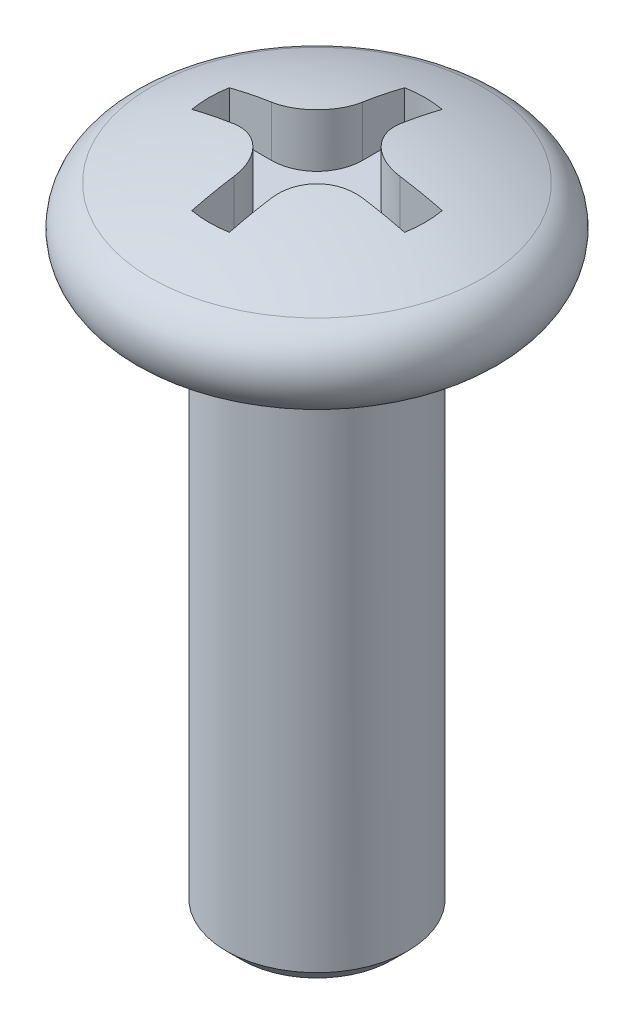
ISO-10303-21;
HEADER;
FILE_DESCRIPTION(('STEP AP214'),'2;1');
FILE_NAME('part.step','',(''),(''),'','','');
FILE_SCHEMA(('AUTOMOTIVE_DESIGN { 1 0 10303 214 1 1 1 1 }'));
ENDSEC;
DATA;
#1=APPLICATION_CONTEXT('core data for automotive mechanical design processes');
#2=APPLICATION_PROTOCOL_DEFINITION('international standard','automotive_design',2000,#1);
#3=PRODUCT_CONTEXT('',#1,'mechanical');
#4=PRODUCT('Part','Part','',(#3));
#5=PRODUCT_RELATED_PRODUCT_CATEGORY('part','',(#4));
#6=PRODUCT_DEFINITION_FORMATION('','',#4);
#7=PRODUCT_DEFINITION_CONTEXT('part definition',#1,'design');
#8=PRODUCT_DEFINITION('design','',#6,#7);
#9=PRODUCT_DEFINITION_SHAPE('','',#8);
#10=(LENGTH_UNIT() NAMED_UNIT(*) SI_UNIT(.MILLI.,.METRE.));
#11=(NAMED_UNIT(*) PLANE_ANGLE_UNIT() SI_UNIT($,.RADIAN.));
#12=(NAMED_UNIT(*) SI_UNIT($,.STERADIAN.) SOLID_ANGLE_UNIT());
#13=UNCERTAINTY_MEASURE_WITH_UNIT(LENGTH_MEASURE(1.E-05),#10,'distance_accuracy_value','');
#14=(GEOMETRIC_REPRESENTATION_CONTEXT(3) GLOBAL_UNCERTAINTY_ASSIGNED_CONTEXT((#13)) GLOBAL_UNIT_ASSIGNED_CONTEXT((#10,
#11,#12)) REPRESENTATION_CONTEXT('',''));
#15=CARTESIAN_POINT('',(0.,0.,0.));
#16=DIRECTION('',(0.,0.,1.));
#17=DIRECTION('',(1.,0.,0.));
#18=AXIS2_PLACEMENT_3D('',#15,#16,#17);
#19=CARTESIAN_POINT('',(0.,0.8,0.));
#20=DIRECTION('',(0.,-1.,0.));
#21=DIRECTION('',(0.,0.,-1.));
#22=AXIS2_PLACEMENT_3D('',#19,#20,#21);
#23=PLANE('',#22);
#24=DIRECTION('',(0.,0.,1.));
#25=VECTOR('',#24,1.);
#26=CARTESIAN_POINT('',(-0.2692388155425,0.8,1.526437178598));
#27=LINE('',#26,#25);
#28=CARTESIAN_POINT('',(-0.2692388155425,0.8,0.9192388155425));
#29=VERTEX_POINT('',#28);
#30=CARTESIAN_POINT('',(-0.2692388155425,0.8,1.52643717859784));
#31=VERTEX_POINT('',#30);
#32=EDGE_CURVE('P0_E159',#29,#31,#27,.T.);
#33=ORIENTED_EDGE('',*,*,#32,.T.);
#34=CARTESIAN_POINT('',(0.,0.8,0.));
#35=DIRECTION('',(0.,-1.,0.));
#36=DIRECTION('',(0.,0.,-1.));
#37=AXIS2_PLACEMENT_3D('',#34,#35,#36);
#38=CIRCLE('',#37,1.55);
#39=CARTESIAN_POINT('',(0.269238815542473,0.8,1.52643717859769));
#40=VERTEX_POINT('',#39);
#41=EDGE_CURVE('P0_E233',#31,#40,#38,.F.);
#42=ORIENTED_EDGE('',*,*,#41,.T.);
#43=DIRECTION('',(0.,0.,-1.));
#44=VECTOR('',#43,1.);
#45=CARTESIAN_POINT('',(0.2692388155425,0.8,0.9192388155425));
#46=LINE('',#45,#44);
#47=CARTESIAN_POINT('',(0.2692388155425,0.8,0.9192388155425));
#48=VERTEX_POINT('',#47);
#49=EDGE_CURVE('P0_E163',#40,#48,#46,.T.);
#50=ORIENTED_EDGE('',*,*,#49,.T.);
#51=CARTESIAN_POINT('',(0.9192388155425,0.8,0.9192388155425));
#52=DIRECTION('',(0.,-1.,0.));
#53=DIRECTION('',(0.,0.,-1.));
#54=AXIS2_PLACEMENT_3D('',#51,#52,#53);
#55=CIRCLE('',#54,0.65);
#56=CARTESIAN_POINT('',(0.9192388155425,0.8,0.2692388155425));
#57=VERTEX_POINT('',#56);
#58=EDGE_CURVE('P0_E166',#57,#48,#55,.F.);
#59=ORIENTED_EDGE('',*,*,#58,.F.);
#60=DIRECTION('',(1.,0.,0.));
#61=VECTOR('',#60,1.);
#62=CARTESIAN_POINT('',(1.526437178598,0.8,0.2692388155425));
#63=LINE('',#62,#61);
#64=CARTESIAN_POINT('',(1.52643717859784,0.8,0.2692388155425));
#65=VERTEX_POINT('',#64);
#66=EDGE_CURVE('P0_E167',#57,#65,#63,.T.);
#67=ORIENTED_EDGE('',*,*,#66,.T.);
#68=CARTESIAN_POINT('',(0.,0.8,0.));
#69=DIRECTION('',(0.,-1.,0.));
#70=DIRECTION('',(0.,0.,-1.));
#71=AXIS2_PLACEMENT_3D('',#68,#69,#70);
#72=CIRCLE('',#71,1.55);
#73=CARTESIAN_POINT('',(1.52643717859769,0.8,-0.269238815542473));
#74=VERTEX_POINT('',#73);
#75=EDGE_CURVE('P0_E244',#65,#74,#72,.F.);
#76=ORIENTED_EDGE('',*,*,#75,.T.);
#77=DIRECTION('',(-1.,0.,0.));
#78=VECTOR('',#77,1.);
#79=CARTESIAN_POINT('',(0.9192388155425,0.8,-0.2692388155425));
#80=LINE('',#79,#78);
#81=CARTESIAN_POINT('',(0.9192388155425,0.8,-0.2692388155425));
#82=VERTEX_POINT('',#81);
#83=EDGE_CURVE('P0_E171',#74,#82,#80,.T.);
#84=ORIENTED_EDGE('',*,*,#83,.T.);
#85=CARTESIAN_POINT('',(0.9192388155425,0.8,-0.9192388155425));
#86=DIRECTION('',(0.,-1.,0.));
#87=DIRECTION('',(0.,0.,-1.));
#88=AXIS2_PLACEMENT_3D('',#85,#86,#87);
#89=CIRCLE('',#88,0.65);
#90=CARTESIAN_POINT('',(0.2692388155425,0.8,-0.9192388155425));
#91=VERTEX_POINT('',#90);
#92=EDGE_CURVE('P0_E174',#91,#82,#89,.F.);
#93=ORIENTED_EDGE('',*,*,#92,.F.);
#94=DIRECTION('',(0.,0.,-1.));
#95=VECTOR('',#94,1.);
#96=CARTESIAN_POINT('',(0.2692388155425,0.8,-1.526437178598));
#97=LINE('',#96,#95);
#98=CARTESIAN_POINT('',(0.2692388155425,0.8,-1.52643717859784));
#99=VERTEX_POINT('',#98);
#100=EDGE_CURVE('P0_E176',#91,#99,#97,.T.);
#101=ORIENTED_EDGE('',*,*,#100,.T.);
#102=CARTESIAN_POINT('',(0.,0.8,0.));
#103=DIRECTION('',(0.,-1.,0.));
#104=DIRECTION('',(0.,0.,-1.));
#105=AXIS2_PLACEMENT_3D('',#102,#103,#104);
#106=CIRCLE('',#105,1.55);
#107=CARTESIAN_POINT('',(-0.269238815542474,0.8,-1.52643717859769));
#108=VERTEX_POINT('',#107);
#109=EDGE_CURVE('P0_E135',#99,#108,#106,.F.);
#110=ORIENTED_EDGE('',*,*,#109,.T.);
#111=DIRECTION('',(0.,0.,1.));
#112=VECTOR('',#111,1.);
#113=CARTESIAN_POINT('',(-0.2692388155425,0.8,-0.9192388155425));
#114=LINE('',#113,#112);
#115=CARTESIAN_POINT('',(-0.2692388155425,0.8,-0.9192388155425));
#116=VERTEX_POINT('',#115);
#117=EDGE_CURVE('P0_E131',#108,#116,#114,.T.);
#118=ORIENTED_EDGE('',*,*,#117,.T.);
#119=CARTESIAN_POINT('',(-0.9192388155425,0.8,-0.9192388155425));
#120=DIRECTION('',(0.,-1.,0.));
#121=DIRECTION('',(0.,0.,-1.));
#122=AXIS2_PLACEMENT_3D('',#119,#120,#121);
#123=CIRCLE('',#122,0.65);
#124=CARTESIAN_POINT('',(-0.9192388155425,0.8,-0.2692388155425));
#125=VERTEX_POINT('',#124);
#126=EDGE_CURVE('P0_E19',#125,#116,#123,.F.);
#127=ORIENTED_EDGE('',*,*,#126,.F.);
#128=DIRECTION('',(-1.,0.,0.));
#129=VECTOR('',#128,1.);
#130=CARTESIAN_POINT('',(-1.526437178598,0.8,-0.2692388155425));
#131=LINE('',#130,#129);
#132=CARTESIAN_POINT('',(-1.52643717859769,0.8,-0.269238815542473));
#133=VERTEX_POINT('',#132);
#134=EDGE_CURVE('P0_E126',#125,#133,#131,.T.);
#135=ORIENTED_EDGE('',*,*,#134,.T.);
#136=CARTESIAN_POINT('',(0.,0.8,0.));
#137=DIRECTION('',(0.,-1.,0.));
#138=DIRECTION('',(0.,0.,-1.));
#139=AXIS2_PLACEMENT_3D('',#136,#137,#138);
#140=CIRCLE('',#139,1.55);
#141=CARTESIAN_POINT('',(-1.52643717859784,0.8,0.2692388155425));
#142=VERTEX_POINT('',#141);
#143=EDGE_CURVE('P0_E241',#133,#142,#140,.F.);
#144=ORIENTED_EDGE('',*,*,#143,.T.);
#145=DIRECTION('',(1.,0.,0.));
#146=VECTOR('',#145,1.);
#147=CARTESIAN_POINT('',(-0.9192388155425,0.8,0.2692388155425));
#148=LINE('',#147,#146);
#149=CARTESIAN_POINT('',(-0.9192388155425,0.8,0.2692388155425));
#150=VERTEX_POINT('',#149);
#151=EDGE_CURVE('P0_E156',#142,#150,#148,.T.);
#152=ORIENTED_EDGE('',*,*,#151,.T.);
#153=CARTESIAN_POINT('',(-0.9192388155425,0.8,0.9192388155425));
#154=DIRECTION('',(0.,-1.,0.));
#155=DIRECTION('',(0.,0.,-1.));
#156=AXIS2_PLACEMENT_3D('',#153,#154,#155);
#157=CIRCLE('',#156,0.65);
#158=EDGE_CURVE('P0_E227',#29,#150,#157,.F.);
#159=ORIENTED_EDGE('',*,*,#158,.F.);
#160=EDGE_LOOP('',(#33,#42,#50,#59,#67,#76,#84,#93,#101,#110,#118,#127,#135,#144,#152,#159));
#161=FACE_BOUND('',#160,.T.);
#162=ADVANCED_FACE('P0_F16',(#161),#23,.F.);
#163=CARTESIAN_POINT('',(-1.526437178598,0.8,-0.2692388155425));
#164=DIRECTION('',(0.,0.,-1.));
#165=DIRECTION('',(-1.,0.,0.));
#166=AXIS2_PLACEMENT_3D('',#163,#164,#165);
#167=PLANE('',#166);
#168=ORIENTED_EDGE('',*,*,#134,.F.);
#169=DIRECTION('',(0.,-1.,0.));
#170=VECTOR('',#169,1.);
#171=CARTESIAN_POINT('',(-0.9192388155425,0.8,-0.2692388155425));
#172=LINE('',#171,#170);
#173=CARTESIAN_POINT('',(-0.919238815542486,1.52471377217491,-0.269238815542499));
#174=VERTEX_POINT('',#173);
#175=EDGE_CURVE('P0_E145',#174,#125,#172,.T.);
#176=ORIENTED_EDGE('',*,*,#175,.F.);
#177=CARTESIAN_POINT('',(-1.52643717859785,1.4008340553469,-0.269238815542501));
#178=CARTESIAN_POINT('',(-1.42628258533272,1.42660341497327,-0.269238815542501));
#179=CARTESIAN_POINT('',(-1.32560542511221,1.44981140452212,-0.269238815542501));
#180=CARTESIAN_POINT('',(-1.12320597076042,1.49110464346476,-0.269238815542499));
#181=CARTESIAN_POINT('',(-1.02148367662914,1.50918989285855,-0.269238815542499));
#182=CARTESIAN_POINT('',(-0.919238815542473,1.52471377217482,-0.269238815542498));
#183=B_SPLINE_CURVE_WITH_KNOTS('',3,(#177,#178,#179,#180,#181,#182),.UNSPECIFIED.,.F.,.F.,(4,2,
4),(0.,0.30995243557794,0.61990487115588),.UNSPECIFIED.);
#184=CARTESIAN_POINT('',(-1.52643717859777,1.40083405534695,-0.269238815542474));
#185=VERTEX_POINT('',#184);
#186=EDGE_CURVE('P0_E224',#185,#174,#183,.T.);
#187=ORIENTED_EDGE('',*,*,#186,.F.);
#188=DIRECTION('',(0.,-1.,0.));
#189=VECTOR('',#188,1.);
#190=CARTESIAN_POINT('',(-1.5264371785977,0.8,-0.269238815542447));
#191=LINE('',#190,#189);
#192=EDGE_CURVE('P0_E239',#185,#133,#191,.T.);
#193=ORIENTED_EDGE('',*,*,#192,.T.);
#194=EDGE_LOOP('',(#168,#176,#187,#193));
#195=FACE_BOUND('',#194,.T.);
#196=ADVANCED_FACE('P0_F284',(#195),#167,.F.);
#197=CARTESIAN_POINT('',(-0.9192388155425,0.8,-0.9192388155425));
#198=DIRECTION('',(0.,-1.,0.));
#199=DIRECTION('',(0.,0.,-1.));
#200=AXIS2_PLACEMENT_3D('',#197,#198,#199);
#201=CYLINDRICAL_SURFACE('',#200,0.65);
#202=DIRECTION('',(0.,1.,0.));
#203=VECTOR('',#202,1.);
#204=CARTESIAN_POINT('',(-0.2692388155425,0.8,-0.9192388155425));
#205=LINE('',#204,#203);
#206=CARTESIAN_POINT('',(-0.2692388155425,1.52471377217491,-0.9192388155425));
#207=VERTEX_POINT('',#206);
#208=EDGE_CURVE('P0_E139',#116,#207,#205,.T.);
#209=ORIENTED_EDGE('',*,*,#208,.T.);
#210=CARTESIAN_POINT('',(-0.919238815542473,1.52471377217482,-0.269238815542498));
#211=CARTESIAN_POINT('',(-0.883271069284549,1.53017838215663,-0.269206596368218));
#212=CARTESIAN_POINT('',(-0.847230957030024,1.53518398680926,-0.272222835690409));
#213=CARTESIAN_POINT('',(-0.776024482266568,1.54415362187527,-0.284194183766014));
#214=CARTESIAN_POINT('',(-0.740857976412674,1.54811782420211,-0.293148311438724));
#215=CARTESIAN_POINT('',(-0.67237147630745,1.5548862554609,-0.31684896030274));
#216=CARTESIAN_POINT('',(-0.639053304502208,1.55768935656104,-0.331601086387426));
#217=CARTESIAN_POINT('',(-0.575297778798747,1.56204492956573,-0.366496760027209));
#218=CARTESIAN_POINT('',(-0.544859240050172,1.56359791783259,-0.386638076978));
#219=CARTESIAN_POINT('',(-0.488097063461272,1.56539571440068,-0.43147904324595));
#220=CARTESIAN_POINT('',(-0.46172860298219,1.56565593228317,-0.456121349806757));
#221=CARTESIAN_POINT('',(-0.413435525795813,1.56490196217993,-0.509414647326527));
#222=CARTESIAN_POINT('',(-0.391510799474459,1.56388780563376,-0.538065539375815));
#223=CARTESIAN_POINT('',(-0.352825154531399,1.56062536432747,-0.598376464130785));
#224=CARTESIAN_POINT('',(-0.336037032537578,1.55838376285364,-0.630019440211366));
#225=CARTESIAN_POINT('',(-0.307904881496571,1.55273696196925,-0.695540633048054));
#226=CARTESIAN_POINT('',(-0.296559537832555,1.54933204387992,-0.729418307797177));
#227=CARTESIAN_POINT('',(-0.281799832125994,1.54249219211063,-0.789390970708279));
#228=CARTESIAN_POINT('',(-0.277087023520738,1.53929822937967,-0.815202930682553));
#229=CARTESIAN_POINT('',(-0.270805742102409,1.53238664939425,-0.867099473917436));
#230=CARTESIAN_POINT('',(-0.269232761212041,1.5286697911244,-0.893183612184108));
#231=CARTESIAN_POINT('',(-0.2692388155425,1.52471377217482,-0.91923881554247));
#232=B_SPLINE_CURVE_WITH_KNOTS('',3,(#210,#211,#212,#213,#214,#215,#216,#217,#218,#219,#220,
#221,#222,#223,#224,#225,#226,#227,#228,#229,#230,#231),.UNSPECIFIED.,.F.,.F.,(4,2,2,2,2,2,2,2,
2,2,4),(0.,0.109017930799935,0.218017853725245,0.327123406477723,0.436183869743588,
0.543941180487169,0.651695832846218,0.758869525629327,0.866017319256549,0.945129051904784,
1.02412711619082),.UNSPECIFIED.);
#233=EDGE_CURVE('P0_E266',#174,#207,#232,.T.);
#234=ORIENTED_EDGE('',*,*,#233,.F.);
#235=ORIENTED_EDGE('',*,*,#175,.T.);
#236=ORIENTED_EDGE('',*,*,#126,.T.);
#237=EDGE_LOOP('',(#209,#234,#235,#236));
#238=FACE_BOUND('',#237,.T.);
#239=ADVANCED_FACE('P0_F142',(#238),#201,.T.);
#240=CARTESIAN_POINT('',(-0.2692388155425,0.8,-0.9192388155425));
#241=DIRECTION('',(-1.,0.,0.));
#242=DIRECTION('',(0.,0.,1.));
#243=AXIS2_PLACEMENT_3D('',#240,#241,#242);
#244=PLANE('',#243);
#245=ORIENTED_EDGE('',*,*,#117,.F.);
#246=DIRECTION('',(0.,-1.,0.));
#247=VECTOR('',#246,1.);
#248=CARTESIAN_POINT('',(-0.269238815542447,0.8,-1.5264371785977));
#249=LINE('',#248,#247);
#250=CARTESIAN_POINT('',(-0.2692388155425,1.40083405534697,-1.52643717859763));
#251=VERTEX_POINT('',#250);
#252=EDGE_CURVE('P0_E151',#108,#251,#249,.F.);
#253=ORIENTED_EDGE('',*,*,#252,.T.);
#254=CARTESIAN_POINT('',(-0.2692388155425,-4.530985590342,0.));
#255=DIRECTION('',(-1.,0.,0.));
#256=DIRECTION('',(0.,0.,1.));
#257=AXIS2_PLACEMENT_3D('',#254,#255,#256);
#258=CIRCLE('',#257,6.12507100115472);
#259=EDGE_CURVE('P0_E148',#207,#251,#258,.T.);
#260=ORIENTED_EDGE('',*,*,#259,.F.);
#261=ORIENTED_EDGE('',*,*,#208,.F.);
#262=EDGE_LOOP('',(#245,#253,#260,#261));
#263=FACE_BOUND('',#262,.T.);
#264=ADVANCED_FACE('P0_F146',(#263),#244,.F.);
#265=CARTESIAN_POINT('',(0.,0.8,0.));
#266=DIRECTION('',(0.,-1.,0.));
#267=DIRECTION('',(0.,0.,-1.));
#268=AXIS2_PLACEMENT_3D('',#265,#266,#267);
#269=CYLINDRICAL_SURFACE('',#268,1.55);
#270=ORIENTED_EDGE('',*,*,#109,.F.);
#271=DIRECTION('',(0.,1.,0.));
#272=VECTOR('',#271,1.);
#273=CARTESIAN_POINT('',(0.2692388155425,0.8,-1.526437178598));
#274=LINE('',#273,#272);
#275=CARTESIAN_POINT('',(0.269238815542501,1.40083405534693,-1.52643717859778));
#276=VERTEX_POINT('',#275);
#277=EDGE_CURVE('P0_E177',#99,#276,#274,.T.);
#278=ORIENTED_EDGE('',*,*,#277,.T.);
#279=CARTESIAN_POINT('',(0.,1.400834055347,0.));
#280=DIRECTION('',(0.,-1.,0.));
#281=DIRECTION('',(0.,0.,-1.));
#282=AXIS2_PLACEMENT_3D('',#279,#280,#281);
#283=CIRCLE('',#282,1.55);
#284=EDGE_CURVE('P0_E254',#251,#276,#283,.T.);
#285=ORIENTED_EDGE('',*,*,#284,.F.);
#286=ORIENTED_EDGE('',*,*,#252,.F.);
#287=EDGE_LOOP('',(#270,#278,#285,#286));
#288=FACE_BOUND('',#287,.T.);
#289=ADVANCED_FACE('P0_F252',(#288),#269,.F.);
#290=CARTESIAN_POINT('',(0.2692388155425,0.8,-1.526437178598));
#291=DIRECTION('',(1.,0.,0.));
#292=DIRECTION('',(0.,0.,-1.));
#293=AXIS2_PLACEMENT_3D('',#290,#291,#292);
#294=PLANE('',#293);
#295=ORIENTED_EDGE('',*,*,#100,.F.);
#296=DIRECTION('',(0.,-1.,0.));
#297=VECTOR('',#296,1.);
#298=CARTESIAN_POINT('',(0.2692388155425,0.8,-0.9192388155425));
#299=LINE('',#298,#297);
#300=CARTESIAN_POINT('',(0.2692388155425,1.52471377217491,-0.9192388155425));
#301=VERTEX_POINT('',#300);
#302=EDGE_CURVE('P0_E246',#301,#91,#299,.T.);
#303=ORIENTED_EDGE('',*,*,#302,.F.);
#304=CARTESIAN_POINT('',(0.269238815542501,-4.530985590342,0.));
#305=DIRECTION('',(-1.,0.,0.));
#306=DIRECTION('',(0.,0.,1.));
#307=AXIS2_PLACEMENT_3D('',#304,#305,#306);
#308=CIRCLE('',#307,6.12507100115472);
#309=EDGE_CURVE('P0_E257',#276,#301,#308,.F.);
#310=ORIENTED_EDGE('',*,*,#309,.F.);
#311=ORIENTED_EDGE('',*,*,#277,.F.);
#312=EDGE_LOOP('',(#295,#303,#310,#311));
#313=FACE_BOUND('',#312,.T.);
#314=ADVANCED_FACE('P0_F258',(#313),#294,.F.);
#315=CARTESIAN_POINT('',(0.9192388155425,0.8,-0.9192388155425));
#316=DIRECTION('',(0.,-1.,0.));
#317=DIRECTION('',(0.,0.,-1.));
#318=AXIS2_PLACEMENT_3D('',#315,#316,#317);
#319=CYLINDRICAL_SURFACE('',#318,0.65);
#320=DIRECTION('',(0.,1.,0.));
#321=VECTOR('',#320,1.);
#322=CARTESIAN_POINT('',(0.9192388155425,0.8,-0.2692388155425));
#323=LINE('',#322,#321);
#324=CARTESIAN_POINT('',(0.919238815542486,1.52471377217491,-0.269238815542499));
#325=VERTEX_POINT('',#324);
#326=EDGE_CURVE('P0_E173',#82,#325,#323,.T.);
#327=ORIENTED_EDGE('',*,*,#326,.T.);
#328=CARTESIAN_POINT('',(0.269238815542501,1.52471377217482,-0.91923881554247));
#329=CARTESIAN_POINT('',(0.269206596368221,1.53017838215663,-0.883271069284547));
#330=CARTESIAN_POINT('',(0.272222835690411,1.53518398680925,-0.847230957030023));
#331=CARTESIAN_POINT('',(0.284194183766012,1.54415362187527,-0.776024482266571));
#332=CARTESIAN_POINT('',(0.293148311438721,1.54811782420211,-0.740857976412679));
#333=CARTESIAN_POINT('',(0.316848960302734,1.5548862554609,-0.672371476307457));
#334=CARTESIAN_POINT('',(0.331601086387421,1.55768935656104,-0.639053304502217));
#335=CARTESIAN_POINT('',(0.366496760027204,1.56204492956573,-0.575297778798759));
#336=CARTESIAN_POINT('',(0.386638076977993,1.56359791783258,-0.544859240050185));
#337=CARTESIAN_POINT('',(0.431479043245941,1.56539571440068,-0.488097063461286));
#338=CARTESIAN_POINT('',(0.456121349806746,1.56565593228317,-0.461728602982201));
#339=CARTESIAN_POINT('',(0.509414647326515,1.56490196217993,-0.413435525795823));
#340=CARTESIAN_POINT('',(0.538065539375803,1.56388780563376,-0.39151079947447));
#341=CARTESIAN_POINT('',(0.598376464130773,1.56062536432747,-0.352825154531409));
#342=CARTESIAN_POINT('',(0.630019440211352,1.55838376285364,-0.336037032537586));
#343=CARTESIAN_POINT('',(0.695540633048038,1.55273696196925,-0.307904881496575));
#344=CARTESIAN_POINT('',(0.729418307797161,1.54933204387992,-0.296559537832558));
#345=CARTESIAN_POINT('',(0.789390970708265,1.54249219211063,-0.281799832125995));
#346=CARTESIAN_POINT('',(0.815202930682542,1.53929822937967,-0.277087023520739));
#347=CARTESIAN_POINT('',(0.867099473917432,1.53238664939425,-0.27080574210241));
#348=CARTESIAN_POINT('',(0.893183612184107,1.5286697911244,-0.269232761212042));
#349=CARTESIAN_POINT('',(0.919238815542472,1.52471377217482,-0.269238815542499));
#350=B_SPLINE_CURVE_WITH_KNOTS('',3,(#328,#329,#330,#331,#332,#333,#334,#335,#336,#337,#338,
#339,#340,#341,#342,#343,#344,#345,#346,#347,#348,#349),.UNSPECIFIED.,.F.,.F.,(4,2,2,2,2,2,2,2,
2,2,4),(0.,0.109017930799931,0.218017853725235,0.327123406477708,0.436183869743569,
0.54394118048715,0.651695832846199,0.758869525629307,0.866017319256528,0.945129051904774,
1.02412711619081),.UNSPECIFIED.);
#351=EDGE_CURVE('P0_E262',#301,#325,#350,.T.);
#352=ORIENTED_EDGE('',*,*,#351,.F.);
#353=ORIENTED_EDGE('',*,*,#302,.T.);
#354=ORIENTED_EDGE('',*,*,#92,.T.);
#355=EDGE_LOOP('',(#327,#352,#353,#354));
#356=FACE_BOUND('',#355,.T.);
#357=ADVANCED_FACE('P0_F403',(#356),#319,.T.);
#358=CARTESIAN_POINT('',(0.9192388155425,0.8,-0.2692388155425));
#359=DIRECTION('',(0.,0.,-1.));
#360=DIRECTION('',(-1.,0.,0.));
#361=AXIS2_PLACEMENT_3D('',#358,#359,#360);
#362=PLANE('',#361);
#363=ORIENTED_EDGE('',*,*,#83,.F.);
#364=DIRECTION('',(0.,-1.,0.));
#365=VECTOR('',#364,1.);
#366=CARTESIAN_POINT('',(1.5264371785977,0.8,-0.269238815542447));
#367=LINE('',#366,#365);
#368=CARTESIAN_POINT('',(1.52643717859769,1.400834055347,-0.269238815542473));
#369=VERTEX_POINT('',#368);
#370=EDGE_CURVE('P0_E170',#74,#369,#367,.F.);
#371=ORIENTED_EDGE('',*,*,#370,.T.);
#372=CARTESIAN_POINT('',(0.919238815542472,1.52471377217482,-0.269238815542498));
#373=CARTESIAN_POINT('',(1.02148367662914,1.50918989285855,-0.269238815542499));
#374=CARTESIAN_POINT('',(1.12320597076042,1.49110464346476,-0.2692388155425));
#375=CARTESIAN_POINT('',(1.32560542511221,1.44981140452212,-0.269238815542501));
#376=CARTESIAN_POINT('',(1.42628258533272,1.42660341497327,-0.269238815542501));
#377=CARTESIAN_POINT('',(1.52643717859785,1.4008340553469,-0.269238815542501));
#378=B_SPLINE_CURVE_WITH_KNOTS('',3,(#372,#373,#374,#375,#376,#377),.UNSPECIFIED.,.F.,.F.,(4,2,
4),(0.,0.30995243557794,0.61990487115588),.UNSPECIFIED.);
#379=EDGE_CURVE('P0_E510',#325,#369,#378,.T.);
#380=ORIENTED_EDGE('',*,*,#379,.F.);
#381=ORIENTED_EDGE('',*,*,#326,.F.);
#382=EDGE_LOOP('',(#363,#371,#380,#381));
#383=FACE_BOUND('',#382,.T.);
#384=ADVANCED_FACE('P0_F395',(#383),#362,.F.);
#385=CARTESIAN_POINT('',(0.,0.8,0.));
#386=DIRECTION('',(0.,-1.,0.));
#387=DIRECTION('',(0.,0.,-1.));
#388=AXIS2_PLACEMENT_3D('',#385,#386,#387);
#389=CYLINDRICAL_SURFACE('',#388,1.55);
#390=ORIENTED_EDGE('',*,*,#143,.F.);
#391=ORIENTED_EDGE('',*,*,#192,.F.);
#392=CARTESIAN_POINT('',(0.,1.400834055347,0.));
#393=DIRECTION('',(0.,-1.,0.));
#394=DIRECTION('',(0.,0.,-1.));
#395=AXIS2_PLACEMENT_3D('',#392,#393,#394);
#396=CIRCLE('',#395,1.55);
#397=CARTESIAN_POINT('',(-1.52643717859784,1.400834055347,0.2692388155425));
#398=VERTEX_POINT('',#397);
#399=EDGE_CURVE('P0_E517',#398,#185,#396,.T.);
#400=ORIENTED_EDGE('',*,*,#399,.F.);
#401=DIRECTION('',(0.,1.,0.));
#402=VECTOR('',#401,1.);
#403=CARTESIAN_POINT('',(-1.526437178598,0.8,0.2692388155425));
#404=LINE('',#403,#402);
#405=EDGE_CURVE('P0_E158',#398,#142,#404,.F.);
#406=ORIENTED_EDGE('',*,*,#405,.T.);
#407=EDGE_LOOP('',(#390,#391,#400,#406));
#408=FACE_BOUND('',#407,.T.);
#409=ADVANCED_FACE('P0_F387',(#408),#389,.F.);
#410=CARTESIAN_POINT('',(0.,0.8,0.));
#411=DIRECTION('',(0.,-1.,0.));
#412=DIRECTION('',(0.,0.,-1.));
#413=AXIS2_PLACEMENT_3D('',#410,#411,#412);
#414=CYLINDRICAL_SURFACE('',#413,1.55);
#415=ORIENTED_EDGE('',*,*,#370,.F.);
#416=ORIENTED_EDGE('',*,*,#75,.F.);
#417=DIRECTION('',(0.,1.,0.));
#418=VECTOR('',#417,1.);
#419=CARTESIAN_POINT('',(1.526437178598,0.8,0.2692388155425));
#420=LINE('',#419,#418);
#421=CARTESIAN_POINT('',(1.52643717859795,1.40083405534694,0.269238815542502));
#422=VERTEX_POINT('',#421);
#423=EDGE_CURVE('P0_E169',#65,#422,#420,.T.);
#424=ORIENTED_EDGE('',*,*,#423,.T.);
#425=CARTESIAN_POINT('',(0.,1.400834055347,0.));
#426=DIRECTION('',(0.,-1.,0.));
#427=DIRECTION('',(0.,0.,-1.));
#428=AXIS2_PLACEMENT_3D('',#425,#426,#427);
#429=CIRCLE('',#428,1.55);
#430=EDGE_CURVE('P0_E519',#369,#422,#429,.T.);
#431=ORIENTED_EDGE('',*,*,#430,.F.);
#432=EDGE_LOOP('',(#415,#416,#424,#431));
#433=FACE_BOUND('',#432,.T.);
#434=ADVANCED_FACE('P0_F379',(#433),#414,.F.);
#435=CARTESIAN_POINT('',(1.526437178598,0.8,0.2692388155425));
#436=DIRECTION('',(0.,0.,1.));
#437=DIRECTION('',(1.,0.,0.));
#438=AXIS2_PLACEMENT_3D('',#435,#436,#437);
#439=PLANE('',#438);
#440=ORIENTED_EDGE('',*,*,#66,.F.);
#441=DIRECTION('',(0.,-1.,0.));
#442=VECTOR('',#441,1.);
#443=CARTESIAN_POINT('',(0.9192388155425,0.8,0.2692388155425));
#444=LINE('',#443,#442);
#445=CARTESIAN_POINT('',(0.919238815542486,1.52471377217491,0.2692388155425));
#446=VERTEX_POINT('',#445);
#447=EDGE_CURVE('P0_E235',#446,#57,#444,.T.);
#448=ORIENTED_EDGE('',*,*,#447,.F.);
#449=CARTESIAN_POINT('',(1.52643717859791,1.40083405534688,0.269238815542503));
#450=CARTESIAN_POINT('',(1.42628258533277,1.42660341497326,0.269238815542501));
#451=CARTESIAN_POINT('',(1.32560542511225,1.44981140452211,0.2692388155425));
#452=CARTESIAN_POINT('',(1.12320597076043,1.49110464346476,0.2692388155425));
#453=CARTESIAN_POINT('',(1.02148367662915,1.50918989285855,0.2692388155425));
#454=CARTESIAN_POINT('',(0.919238815542472,1.52471377217482,0.269238815542501));
#455=B_SPLINE_CURVE_WITH_KNOTS('',3,(#449,#450,#451,#452,#453,#454),.UNSPECIFIED.,.F.,.F.,(4,2,
4),(0.,0.30995243557797,0.619904871155939),.UNSPECIFIED.);
#456=EDGE_CURVE('P0_E521',#422,#446,#455,.T.);
#457=ORIENTED_EDGE('',*,*,#456,.F.);
#458=ORIENTED_EDGE('',*,*,#423,.F.);
#459=EDGE_LOOP('',(#440,#448,#457,#458));
#460=FACE_BOUND('',#459,.T.);
#461=ADVANCED_FACE('P0_F371',(#460),#439,.F.);
#462=CARTESIAN_POINT('',(0.9192388155425,0.8,0.9192388155425));
#463=DIRECTION('',(0.,-1.,0.));
#464=DIRECTION('',(0.,0.,-1.));
#465=AXIS2_PLACEMENT_3D('',#462,#463,#464);
#466=CYLINDRICAL_SURFACE('',#465,0.65);
#467=DIRECTION('',(0.,1.,0.));
#468=VECTOR('',#467,1.);
#469=CARTESIAN_POINT('',(0.2692388155425,0.8,0.9192388155425));
#470=LINE('',#469,#468);
#471=CARTESIAN_POINT('',(0.2692388155425,1.52471377217491,0.9192388155425));
#472=VERTEX_POINT('',#471);
#473=EDGE_CURVE('P0_E165',#48,#472,#470,.T.);
#474=ORIENTED_EDGE('',*,*,#473,.T.);
#475=CARTESIAN_POINT('',(0.919238815542472,1.52471377217482,0.269238815542501));
#476=CARTESIAN_POINT('',(0.883271069284549,1.53017838215663,0.269206596368221));
#477=CARTESIAN_POINT('',(0.847230957030023,1.53518398680926,0.272222835690411));
#478=CARTESIAN_POINT('',(0.776024482266568,1.54415362187527,0.284194183766013));
#479=CARTESIAN_POINT('',(0.740857976412674,1.54811782420211,0.293148311438721));
#480=CARTESIAN_POINT('',(0.672371476307451,1.5548862554609,0.316848960302736));
#481=CARTESIAN_POINT('',(0.639053304502209,1.55768935656104,0.331601086387424));
#482=CARTESIAN_POINT('',(0.575297778798748,1.56204492956573,0.366496760027211));
#483=CARTESIAN_POINT('',(0.544859240050174,1.56359791783259,0.386638076978003));
#484=CARTESIAN_POINT('',(0.488097063461274,1.56539571440068,0.431479043245953));
#485=CARTESIAN_POINT('',(0.461728602982189,1.56565593228317,0.456121349806758));
#486=CARTESIAN_POINT('',(0.413435525795812,1.56490196217993,0.509414647326527));
#487=CARTESIAN_POINT('',(0.391510799474461,1.56388780563376,0.538065539375816));
#488=CARTESIAN_POINT('',(0.352825154531402,1.56062536432747,0.598376464130787));
#489=CARTESIAN_POINT('',(0.336037032537579,1.55838376285364,0.630019440211366));
#490=CARTESIAN_POINT('',(0.307904881496571,1.55273696196925,0.695540633048052));
#491=CARTESIAN_POINT('',(0.296559537832555,1.54933204387992,0.729418307797175));
#492=CARTESIAN_POINT('',(0.281799832125994,1.54249219211063,0.789390970708277));
#493=CARTESIAN_POINT('',(0.277087023520738,1.53929822937967,0.815202930682552));
#494=CARTESIAN_POINT('',(0.270805742102409,1.53238664939425,0.867099473917437));
#495=CARTESIAN_POINT('',(0.269232761212041,1.5286697911244,0.893183612184109));
#496=CARTESIAN_POINT('',(0.2692388155425,1.52471377217482,0.919238815542472));
#497=B_SPLINE_CURVE_WITH_KNOTS('',3,(#475,#476,#477,#478,#479,#480,#481,#482,#483,#484,#485,
#486,#487,#488,#489,#490,#491,#492,#493,#494,#495,#496),.UNSPECIFIED.,.F.,.F.,(4,2,2,2,2,2,2,2,
2,2,4),(0.,0.109017930799935,0.218017853725243,0.327123406477721,0.436183869743588,
0.543941180487168,0.651695832846217,0.758869525629324,0.866017319256545,0.945129051904783,
1.02412711619082),.UNSPECIFIED.);
#498=EDGE_CURVE('P0_E528',#446,#472,#497,.T.);
#499=ORIENTED_EDGE('',*,*,#498,.F.);
#500=ORIENTED_EDGE('',*,*,#447,.T.);
#501=ORIENTED_EDGE('',*,*,#58,.T.);
#502=EDGE_LOOP('',(#474,#499,#500,#501));
#503=FACE_BOUND('',#502,.T.);
#504=ADVANCED_FACE('P0_F363',(#503),#466,.T.);
#505=CARTESIAN_POINT('',(0.2692388155425,0.8,0.9192388155425));
#506=DIRECTION('',(1.,0.,0.));
#507=DIRECTION('',(0.,0.,-1.));
#508=AXIS2_PLACEMENT_3D('',#505,#506,#507);
#509=PLANE('',#508);
#510=ORIENTED_EDGE('',*,*,#49,.F.);
#511=DIRECTION('',(0.,-1.,0.));
#512=VECTOR('',#511,1.);
#513=CARTESIAN_POINT('',(0.269238815542447,0.8,1.5264371785977));
#514=LINE('',#513,#512);
#515=CARTESIAN_POINT('',(0.269238815542501,1.40083405534697,1.52643717859763));
#516=VERTEX_POINT('',#515);
#517=EDGE_CURVE('P0_E162',#40,#516,#514,.F.);
#518=ORIENTED_EDGE('',*,*,#517,.T.);
#519=CARTESIAN_POINT('',(0.269238815542501,-4.530985590342,0.));
#520=DIRECTION('',(-1.,0.,0.));
#521=DIRECTION('',(0.,0.,1.));
#522=AXIS2_PLACEMENT_3D('',#519,#520,#521);
#523=CIRCLE('',#522,6.12507100115472);
#524=EDGE_CURVE('P0_E538',#472,#516,#523,.F.);
#525=ORIENTED_EDGE('',*,*,#524,.F.);
#526=ORIENTED_EDGE('',*,*,#473,.F.);
#527=EDGE_LOOP('',(#510,#518,#525,#526));
#528=FACE_BOUND('',#527,.T.);
#529=ADVANCED_FACE('P0_F355',(#528),#509,.F.);
#530=CARTESIAN_POINT('',(0.,0.8,0.));
#531=DIRECTION('',(0.,-1.,0.));
#532=DIRECTION('',(0.,0.,-1.));
#533=AXIS2_PLACEMENT_3D('',#530,#531,#532);
#534=CYLINDRICAL_SURFACE('',#533,1.55);
#535=ORIENTED_EDGE('',*,*,#41,.F.);
#536=DIRECTION('',(0.,1.,0.));
#537=VECTOR('',#536,1.);
#538=CARTESIAN_POINT('',(-0.2692388155425,0.8,1.526437178598));
#539=LINE('',#538,#537);
#540=CARTESIAN_POINT('',(-0.2692388155425,1.40083405534693,1.52643717859778));
#541=VERTEX_POINT('',#540);
#542=EDGE_CURVE('P0_E161',#31,#541,#539,.T.);
#543=ORIENTED_EDGE('',*,*,#542,.T.);
#544=CARTESIAN_POINT('',(0.,1.400834055347,0.));
#545=DIRECTION('',(0.,-1.,0.));
#546=DIRECTION('',(0.,0.,-1.));
#547=AXIS2_PLACEMENT_3D('',#544,#545,#546);
#548=CIRCLE('',#547,1.55);
#549=EDGE_CURVE('P0_E541',#516,#541,#548,.T.);
#550=ORIENTED_EDGE('',*,*,#549,.F.);
#551=ORIENTED_EDGE('',*,*,#517,.F.);
#552=EDGE_LOOP('',(#535,#543,#550,#551));
#553=FACE_BOUND('',#552,.T.);
#554=ADVANCED_FACE('P0_F347',(#553),#534,.F.);
#555=CARTESIAN_POINT('',(-0.2692388155425,0.8,1.526437178598));
#556=DIRECTION('',(-1.,0.,0.));
#557=DIRECTION('',(0.,0.,1.));
#558=AXIS2_PLACEMENT_3D('',#555,#556,#557);
#559=PLANE('',#558);
#560=ORIENTED_EDGE('',*,*,#32,.F.);
#561=DIRECTION('',(0.,-1.,0.));
#562=VECTOR('',#561,1.);
#563=CARTESIAN_POINT('',(-0.2692388155425,0.8,0.9192388155425));
#564=LINE('',#563,#562);
#565=CARTESIAN_POINT('',(-0.2692388155425,1.52471377217491,0.9192388155425));
#566=VERTEX_POINT('',#565);
#567=EDGE_CURVE('P0_E228',#566,#29,#564,.T.);
#568=ORIENTED_EDGE('',*,*,#567,.F.);
#569=CARTESIAN_POINT('',(-0.2692388155425,-4.530985590342,0.));
#570=DIRECTION('',(-1.,0.,0.));
#571=DIRECTION('',(0.,0.,1.));
#572=AXIS2_PLACEMENT_3D('',#569,#570,#571);
#573=CIRCLE('',#572,6.12507100115472);
#574=EDGE_CURVE('P0_E543',#541,#566,#573,.T.);
#575=ORIENTED_EDGE('',*,*,#574,.F.);
#576=ORIENTED_EDGE('',*,*,#542,.F.);
#577=EDGE_LOOP('',(#560,#568,#575,#576));
#578=FACE_BOUND('',#577,.T.);
#579=ADVANCED_FACE('P0_F341',(#578),#559,.F.);
#580=CARTESIAN_POINT('',(-0.9192388155425,0.8,0.9192388155425));
#581=DIRECTION('',(0.,-1.,0.));
#582=DIRECTION('',(0.,0.,-1.));
#583=AXIS2_PLACEMENT_3D('',#580,#581,#582);
#584=CYLINDRICAL_SURFACE('',#583,0.65);
#585=DIRECTION('',(0.,1.,0.));
#586=VECTOR('',#585,1.);
#587=CARTESIAN_POINT('',(-0.9192388155425,0.8,0.2692388155425));
#588=LINE('',#587,#586);
#589=CARTESIAN_POINT('',(-0.919238815542486,1.52471377217491,0.2692388155425));
#590=VERTEX_POINT('',#589);
#591=EDGE_CURVE('P0_E34',#150,#590,#588,.T.);
#592=ORIENTED_EDGE('',*,*,#591,.T.);
#593=CARTESIAN_POINT('',(-0.2692388155425,1.52471377217482,0.919238815542472));
#594=CARTESIAN_POINT('',(-0.269206596368219,1.53017838215663,0.883271069284551));
#595=CARTESIAN_POINT('',(-0.272222835690409,1.53518398680925,0.847230957030027));
#596=CARTESIAN_POINT('',(-0.284194183766012,1.54415362187527,0.776024482266577));
#597=CARTESIAN_POINT('',(-0.293148311438721,1.54811782420211,0.740857976412686));
#598=CARTESIAN_POINT('',(-0.316848960302733,1.5548862554609,0.672371476307465));
#599=CARTESIAN_POINT('',(-0.331601086387418,1.55768935656104,0.639053304502224));
#600=CARTESIAN_POINT('',(-0.366496760027199,1.56204492956572,0.575297778798766));
#601=CARTESIAN_POINT('',(-0.386638076977989,1.56359791783258,0.544859240050192));
#602=CARTESIAN_POINT('',(-0.431479043245936,1.56539571440068,0.488097063461292));
#603=CARTESIAN_POINT('',(-0.456121349806741,1.56565593228317,0.461728602982206));
#604=CARTESIAN_POINT('',(-0.509414647326509,1.56490196217993,0.413435525795826));
#605=CARTESIAN_POINT('',(-0.538065539375796,1.56388780563376,0.391510799474472));
#606=CARTESIAN_POINT('',(-0.598376464130766,1.56062536432747,0.352825154531411));
#607=CARTESIAN_POINT('',(-0.630019440211345,1.55838376285364,0.336037032537588));
#608=CARTESIAN_POINT('',(-0.695540633048032,1.55273696196926,0.307904881496579));
#609=CARTESIAN_POINT('',(-0.729418307797154,1.54933204387992,0.296559537832562));
#610=CARTESIAN_POINT('',(-0.789390970708259,1.54249219211063,0.281799832125997));
#611=CARTESIAN_POINT('',(-0.815202930682537,1.53929822937968,0.27708702352074));
#612=CARTESIAN_POINT('',(-0.86709947391743,1.53238664939425,0.270805742102409));
#613=CARTESIAN_POINT('',(-0.893183612184106,1.5286697911244,0.269232761212042));
#614=CARTESIAN_POINT('',(-0.919238815542473,1.52471377217482,0.269238815542501));
#615=B_SPLINE_CURVE_WITH_KNOTS('',3,(#593,#594,#595,#596,#597,#598,#599,#600,#601,#602,#603,
#604,#605,#606,#607,#608,#609,#610,#611,#612,#613,#614),.UNSPECIFIED.,.F.,.F.,(4,2,2,2,2,2,2,2,
2,2,4),(0.,0.109017930799929,0.21801785372523,0.327123406477702,0.436183869743564,
0.543941180487145,0.651695832846195,0.758869525629302,0.866017319256523,0.945129051904773,
1.02412711619082),.UNSPECIFIED.);
#616=EDGE_CURVE('P0_E199',#566,#590,#615,.T.);
#617=ORIENTED_EDGE('',*,*,#616,.F.);
#618=ORIENTED_EDGE('',*,*,#567,.T.);
#619=ORIENTED_EDGE('',*,*,#158,.T.);
#620=EDGE_LOOP('',(#592,#617,#618,#619));
#621=FACE_BOUND('',#620,.T.);
#622=ADVANCED_FACE('P0_F334',(#621),#584,.T.);
#623=CARTESIAN_POINT('',(-0.9192388155425,0.8,0.2692388155425));
#624=DIRECTION('',(0.,0.,1.));
#625=DIRECTION('',(1.,0.,0.));
#626=AXIS2_PLACEMENT_3D('',#623,#624,#625);
#627=PLANE('',#626);
#628=ORIENTED_EDGE('',*,*,#151,.F.);
#629=ORIENTED_EDGE('',*,*,#405,.F.);
#630=CARTESIAN_POINT('',(-0.919238815542473,1.52471377217482,0.269238815542501));
#631=CARTESIAN_POINT('',(-1.02148367662915,1.50918989285855,0.269238815542501));
#632=CARTESIAN_POINT('',(-1.12320597076044,1.49110464346476,0.269238815542501));
#633=CARTESIAN_POINT('',(-1.32560542511225,1.44981140452211,0.269238815542499));
#634=CARTESIAN_POINT('',(-1.42628258533277,1.42660341497326,0.269238815542497));
#635=CARTESIAN_POINT('',(-1.52643717859791,1.40083405534688,0.269238815542494));
#636=B_SPLINE_CURVE_WITH_KNOTS('',3,(#630,#631,#632,#633,#634,#635),.UNSPECIFIED.,.F.,.F.,(4,2,
4),(0.,0.309952435577969,0.619904871155939),.UNSPECIFIED.);
#637=EDGE_CURVE('P0_E190',#590,#398,#636,.T.);
#638=ORIENTED_EDGE('',*,*,#637,.F.);
#639=ORIENTED_EDGE('',*,*,#591,.F.);
#640=EDGE_LOOP('',(#628,#629,#638,#639));
#641=FACE_BOUND('',#640,.T.);
#642=ADVANCED_FACE('P0_F206',(#641),#627,.F.);
#643=CARTESIAN_POINT('',(0.,-4.530985590342,0.));
#644=DIRECTION('',(-1.,0.,0.));
#645=DIRECTION('',(0.,0.,-1.));
#646=AXIS2_PLACEMENT_3D('',#643,#644,#645);
#647=SPHERICAL_SURFACE('',#646,6.130985590342);
#648=CARTESIAN_POINT('',(0.,1.12000000000007,0.));
#649=DIRECTION('',(0.,-1.,0.));
#650=DIRECTION('',(-1.,0.,0.));
#651=AXIS2_PLACEMENT_3D('',#648,#649,#650);
#652=CIRCLE('',#651,2.37809717352503);
#653=CARTESIAN_POINT('',(-2.37809717352503,1.12000000000007,0.));
#654=VERTEX_POINT('',#653);
#655=EDGE_CURVE('P0_E187',#654,#654,#652,.T.);
#656=ORIENTED_EDGE('',*,*,#655,.F.);
#657=EDGE_LOOP('',(#656));
#658=FACE_BOUND('',#657,.T.);
#659=ORIENTED_EDGE('',*,*,#616,.T.);
#660=ORIENTED_EDGE('',*,*,#637,.T.);
#661=ORIENTED_EDGE('',*,*,#399,.T.);
#662=ORIENTED_EDGE('',*,*,#186,.T.);
#663=ORIENTED_EDGE('',*,*,#233,.T.);
#664=ORIENTED_EDGE('',*,*,#259,.T.);
#665=ORIENTED_EDGE('',*,*,#284,.T.);
#666=ORIENTED_EDGE('',*,*,#309,.T.);
#667=ORIENTED_EDGE('',*,*,#351,.T.);
#668=ORIENTED_EDGE('',*,*,#379,.T.);
#669=ORIENTED_EDGE('',*,*,#430,.T.);
#670=ORIENTED_EDGE('',*,*,#456,.T.);
#671=ORIENTED_EDGE('',*,*,#498,.T.);
#672=ORIENTED_EDGE('',*,*,#524,.T.);
#673=ORIENTED_EDGE('',*,*,#549,.T.);
#674=ORIENTED_EDGE('',*,*,#574,.T.);
#675=EDGE_LOOP('',(#659,#660,#661,#662,#663,#664,#665,#666,#667,#668,#669,#670,#671,#672,#673,#674));
#676=FACE_BOUND('',#675,.T.);
#677=ADVANCED_FACE('P0_F208',(#658,#676),#647,.T.);
#678=CARTESIAN_POINT('',(0.,0.56,0.));
#679=DIRECTION('',(0.,-1.,0.));
#680=DIRECTION('',(-1.,0.,0.));
#681=AXIS2_PLACEMENT_3D('',#678,#679,#680);
#682=TOROIDAL_SURFACE('',#681,2.142433076372,0.6075669236282);
#683=CARTESIAN_POINT('',(0.,0.,0.));
#684=DIRECTION('',(0.,-1.,0.));
#685=DIRECTION('',(0.,0.,-1.));
#686=AXIS2_PLACEMENT_3D('',#683,#684,#685);
#687=CIRCLE('',#686,2.3780971735252);
#688=CARTESIAN_POINT('',(0.,0.,-2.3780971735252));
#689=VERTEX_POINT('',#688);
#690=EDGE_CURVE('P0_E184',#689,#689,#687,.T.);
#691=ORIENTED_EDGE('',*,*,#690,.F.);
#692=EDGE_LOOP('',(#691));
#693=FACE_BOUND('',#692,.T.);
#694=ORIENTED_EDGE('',*,*,#655,.T.);
#695=EDGE_LOOP('',(#694));
#696=FACE_BOUND('',#695,.T.);
#697=ADVANCED_FACE('P0_F213',(#693,#696),#682,.T.);
#698=CARTESIAN_POINT('',(0.,-8.,0.));
#699=DIRECTION('',(0.,-1.,0.));
#700=DIRECTION('',(0.,0.,-1.));
#701=AXIS2_PLACEMENT_3D('',#698,#699,#700);
#702=PLANE('',#701);
#703=CARTESIAN_POINT('',(0.,-7.99999999998136,0.));
#704=DIRECTION('',(0.,1.,0.));
#705=DIRECTION('',(0.,0.,1.));
#706=AXIS2_PLACEMENT_3D('',#703,#704,#705);
#707=CIRCLE('',#706,1.07500000001437);
#708=CARTESIAN_POINT('',(0.,-7.99999999998136,1.07500000001437));
#709=VERTEX_POINT('',#708);
#710=EDGE_CURVE('P0_E181',#709,#709,#707,.T.);
#711=ORIENTED_EDGE('',*,*,#710,.F.);
#712=EDGE_LOOP('',(#711));
#713=FACE_BOUND('',#712,.T.);
#714=ADVANCED_FACE('P0_F306',(#713),#702,.T.);
#715=CARTESIAN_POINT('',(0.,0.,0.));
#716=DIRECTION('',(0.,-1.,0.));
#717=DIRECTION('',(0.,0.,-1.));
#718=AXIS2_PLACEMENT_3D('',#715,#716,#717);
#719=PLANE('',#718);
#720=CARTESIAN_POINT('',(0.,0.,0.));
#721=DIRECTION('',(0.,-1.,0.));
#722=DIRECTION('',(0.,0.,-1.));
#723=AXIS2_PLACEMENT_3D('',#720,#721,#722);
#724=CIRCLE('',#723,1.3);
#725=CARTESIAN_POINT('',(0.,0.,-1.3));
#726=VERTEX_POINT('',#725);
#727=EDGE_CURVE('P0_E25',#726,#726,#724,.T.);
#728=ORIENTED_EDGE('',*,*,#727,.F.);
#729=EDGE_LOOP('',(#728));
#730=FACE_BOUND('',#729,.T.);
#731=ORIENTED_EDGE('',*,*,#690,.T.);
#732=EDGE_LOOP('',(#731));
#733=FACE_BOUND('',#732,.T.);
#734=ADVANCED_FACE('P0_F300',(#730,#733),#719,.T.);
#735=CARTESIAN_POINT('',(0.,-7.77499999998099,0.));
#736=DIRECTION('',(0.,1.,0.));
#737=DIRECTION('',(0.,0.,1.));
#738=AXIS2_PLACEMENT_3D('',#735,#736,#737);
#739=CONICAL_SURFACE('',#738,1.30000000001473,0.785398163397448);
#740=CARTESIAN_POINT('',(0.,-7.775,0.));
#741=DIRECTION('',(0.,-1.,0.));
#742=DIRECTION('',(0.,0.,-1.));
#743=AXIS2_PLACEMENT_3D('',#740,#741,#742);
#744=CIRCLE('',#743,1.3);
#745=CARTESIAN_POINT('',(0.,-7.775,-1.3));
#746=VERTEX_POINT('',#745);
#747=EDGE_CURVE('P0_E11',#746,#746,#744,.F.);
#748=ORIENTED_EDGE('',*,*,#747,.F.);
#749=EDGE_LOOP('',(#748));
#750=FACE_BOUND('',#749,.T.);
#751=ORIENTED_EDGE('',*,*,#710,.T.);
#752=EDGE_LOOP('',(#751));
#753=FACE_BOUND('',#752,.T.);
#754=ADVANCED_FACE('P0_F294',(#750,#753),#739,.T.);
#755=CARTESIAN_POINT('',(0.,2.08,0.));
#756=DIRECTION('',(0.,-1.,0.));
#757=DIRECTION('',(0.,0.,-1.));
#758=AXIS2_PLACEMENT_3D('',#755,#756,#757);
#759=CYLINDRICAL_SURFACE('',#758,1.3);
#760=ORIENTED_EDGE('',*,*,#727,.T.);
#761=EDGE_LOOP('',(#760));
#762=FACE_BOUND('',#761,.T.);
#763=ORIENTED_EDGE('',*,*,#747,.T.);
#764=EDGE_LOOP('',(#763));
#765=FACE_BOUND('',#764,.T.);
#766=ADVANCED_FACE('P0_F292',(#762,#765),#759,.T.);
#767=CLOSED_SHELL('',(#162,#196,#239,#264,#289,#314,#357,#384,#409,#434,#461,#504,#529,#554,
#579,#622,#642,#677,#697,#714,#734,#754,#766));
#768=MANIFOLD_SOLID_BREP('P0_B1',#767);
#769=CARTESIAN_POINT('',(0.,-8.,0.));
#770=DIRECTION('',(0.,1.,0.));
#771=DIRECTION('',(0.,0.,1.));
#772=AXIS2_PLACEMENT_3D('',#769,#770,#771);
#773=CYLINDRICAL_SURFACE('',#772,1.075);
#774=CARTESIAN_POINT('',(0.,0.,0.));
#775=DIRECTION('',(0.,1.,0.));
#776=DIRECTION('',(0.,0.,1.));
#777=AXIS2_PLACEMENT_3D('',#774,#775,#776);
#778=CIRCLE('',#777,1.075);
#779=CARTESIAN_POINT('',(0.,0.,1.075));
#780=VERTEX_POINT('',#779);
#781=EDGE_CURVE('P1_E15',#780,#780,#778,.F.);
#782=ORIENTED_EDGE('',*,*,#781,.T.);
#783=EDGE_LOOP('',(#782));
#784=FACE_BOUND('',#783,.T.);
#785=CARTESIAN_POINT('',(0.,-8.,0.));
#786=DIRECTION('',(0.,1.,0.));
#787=DIRECTION('',(0.,0.,1.));
#788=AXIS2_PLACEMENT_3D('',#785,#786,#787);
#789=CIRCLE('',#788,1.075);
#790=CARTESIAN_POINT('',(0.,-8.,1.075));
#791=VERTEX_POINT('',#790);
#792=EDGE_CURVE('P1_E10',#791,#791,#789,.T.);
#793=ORIENTED_EDGE('',*,*,#792,.T.);
#794=EDGE_LOOP('',(#793));
#795=FACE_BOUND('',#794,.T.);
#796=ADVANCED_FACE('P1_F14',(#784,#795),#773,.T.);
#797=OPEN_SHELL('',(#796));
#798=SHELL_BASED_SURFACE_MODEL('P1_B1',(#797));
#799=ADVANCED_BREP_SHAPE_REPRESENTATION('',(#18,#768),#14);
#800=MANIFOLD_SURFACE_SHAPE_REPRESENTATION('',(#18,#798),#14);
#801=SHAPE_REPRESENTATION('',(#18),#14);
#802=SHAPE_DEFINITION_REPRESENTATION(#9,#801);
#803=SHAPE_REPRESENTATION_RELATIONSHIP('','',#801,#799);
#804=SHAPE_REPRESENTATION_RELATIONSHIP('','',#801,#800);
ENDSEC;
END-ISO-10303-21;
